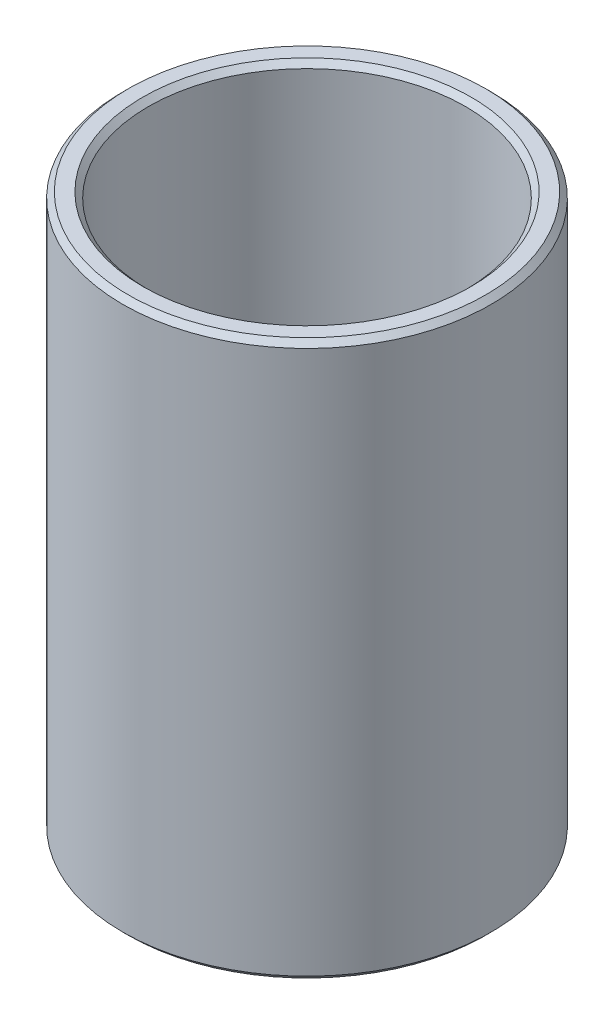
ISO-10303-21;
HEADER;
FILE_DESCRIPTION(('STEP AP214'),'2;1');
FILE_NAME('part.step','',(''),(''),'','','');
FILE_SCHEMA(('AUTOMOTIVE_DESIGN { 1 0 10303 214 1 1 1 1 }'));
ENDSEC;
DATA;
#1=APPLICATION_CONTEXT('core data for automotive mechanical design processes');
#2=APPLICATION_PROTOCOL_DEFINITION('international standard','automotive_design',2000,#1);
#3=PRODUCT_CONTEXT('',#1,'mechanical');
#4=PRODUCT('Part','Part','',(#3));
#5=PRODUCT_RELATED_PRODUCT_CATEGORY('part','',(#4));
#6=PRODUCT_DEFINITION_FORMATION('','',#4);
#7=PRODUCT_DEFINITION_CONTEXT('part definition',#1,'design');
#8=PRODUCT_DEFINITION('design','',#6,#7);
#9=PRODUCT_DEFINITION_SHAPE('','',#8);
#10=(LENGTH_UNIT() NAMED_UNIT(*) SI_UNIT(.MILLI.,.METRE.));
#11=(NAMED_UNIT(*) PLANE_ANGLE_UNIT() SI_UNIT($,.RADIAN.));
#12=(NAMED_UNIT(*) SI_UNIT($,.STERADIAN.) SOLID_ANGLE_UNIT());
#13=UNCERTAINTY_MEASURE_WITH_UNIT(LENGTH_MEASURE(1.E-05),#10,'distance_accuracy_value','');
#14=(GEOMETRIC_REPRESENTATION_CONTEXT(3) GLOBAL_UNCERTAINTY_ASSIGNED_CONTEXT((#13)) GLOBAL_UNIT_ASSIGNED_CONTEXT((#10,
#11,#12)) REPRESENTATION_CONTEXT('',''));
#15=CARTESIAN_POINT('',(0.,0.,0.));
#16=DIRECTION('',(0.,0.,1.));
#17=DIRECTION('',(1.,0.,0.));
#18=AXIS2_PLACEMENT_3D('',#15,#16,#17);
#19=CARTESIAN_POINT('',(0.,150.586596938026,0.));
#20=DIRECTION('',(0.,-1.,0.));
#21=DIRECTION('',(0.,0.,-1.));
#22=AXIS2_PLACEMENT_3D('',#19,#20,#21);
#23=CYLINDRICAL_SURFACE('',#22,50.);
#24=CARTESIAN_POINT('',(0.,1.48675893451039,0.));
#25=DIRECTION('',(0.,1.,0.));
#26=DIRECTION('',(0.,0.,1.));
#27=AXIS2_PLACEMENT_3D('',#24,#25,#26);
#28=CIRCLE('',#27,50.);
#29=CARTESIAN_POINT('',(0.,1.48675893451039,-50.));
#30=VERTEX_POINT('',#29);
#31=EDGE_CURVE('E10',#30,#30,#28,.T.);
#32=CARTESIAN_POINT('',(0.,149.099838003515,0.));
#33=DIRECTION('',(0.,1.,0.));
#34=DIRECTION('',(0.,0.,1.));
#35=AXIS2_PLACEMENT_3D('',#32,#33,#34);
#36=CIRCLE('',#35,50.);
#37=CARTESIAN_POINT('',(0.,149.099838003515,-50.));
#38=VERTEX_POINT('',#37);
#39=EDGE_CURVE('E50',#38,#38,#36,.F.);
#40=CARTESIAN_POINT('',(0.,1.48675893451039,-50.));
#41=CARTESIAN_POINT('',(0.,3.02439517481253,-50.));
#42=CARTESIAN_POINT('',(0.,4.56203141511467,-50.));
#43=CARTESIAN_POINT('',(0.,7.63730389571894,-50.));
#44=CARTESIAN_POINT('',(0.,9.17494013602107,-50.));
#45=CARTESIAN_POINT('',(0.,12.2502126166253,-50.));
#46=CARTESIAN_POINT('',(0.,13.7878488569275,-50.));
#47=CARTESIAN_POINT('',(0.,16.8631213375317,-50.));
#48=CARTESIAN_POINT('',(0.,18.4007575778339,-50.));
#49=CARTESIAN_POINT('',(0.,21.4760300584381,-50.));
#50=CARTESIAN_POINT('',(0.,23.0136662987403,-50.));
#51=CARTESIAN_POINT('',(0.,26.0889387793446,-50.));
#52=CARTESIAN_POINT('',(0.,27.6265750196467,-50.));
#53=CARTESIAN_POINT('',(0.,30.701847500251,-50.));
#54=CARTESIAN_POINT('',(0.,32.2394837405531,-50.));
#55=CARTESIAN_POINT('',(0.,35.3147562211574,-50.));
#56=CARTESIAN_POINT('',(0.,36.8523924614595,-50.));
#57=CARTESIAN_POINT('',(0.,39.9276649420638,-50.));
#58=CARTESIAN_POINT('',(0.,41.4653011823659,-50.));
#59=CARTESIAN_POINT('',(0.,44.5405736629702,-50.));
#60=CARTESIAN_POINT('',(0.,46.0782099032723,-50.));
#61=CARTESIAN_POINT('',(0.,49.1534823838766,-50.));
#62=CARTESIAN_POINT('',(0.,50.6911186241787,-50.));
#63=CARTESIAN_POINT('',(0.,53.766391104783,-50.));
#64=CARTESIAN_POINT('',(0.,55.3040273450851,-50.));
#65=CARTESIAN_POINT('',(0.,58.3792998256894,-50.));
#66=CARTESIAN_POINT('',(0.,59.9169360659915,-50.));
#67=CARTESIAN_POINT('',(0.,62.9922085465958,-50.));
#68=CARTESIAN_POINT('',(0.,64.529844786898,-50.));
#69=CARTESIAN_POINT('',(0.,67.6051172675022,-50.));
#70=CARTESIAN_POINT('',(0.,69.1427535078044,-50.));
#71=CARTESIAN_POINT('',(0.,72.2180259884086,-50.));
#72=CARTESIAN_POINT('',(0.,73.7556622287108,-50.));
#73=CARTESIAN_POINT('',(0.,76.830934709315,-50.));
#74=CARTESIAN_POINT('',(0.,78.3685709496172,-50.));
#75=CARTESIAN_POINT('',(0.,81.4438434302214,-50.));
#76=CARTESIAN_POINT('',(0.,82.9814796705236,-50.));
#77=CARTESIAN_POINT('',(0.,86.0567521511278,-50.));
#78=CARTESIAN_POINT('',(0.,87.59438839143,-50.));
#79=CARTESIAN_POINT('',(0.,90.6696608720342,-50.));
#80=CARTESIAN_POINT('',(0.,92.2072971123364,-50.));
#81=CARTESIAN_POINT('',(0.,95.2825695929406,-50.));
#82=CARTESIAN_POINT('',(0.,96.8202058332428,-50.));
#83=CARTESIAN_POINT('',(0.,99.8954783138471,-50.));
#84=CARTESIAN_POINT('',(0.,101.433114554149,-50.));
#85=CARTESIAN_POINT('',(0.,104.508387034753,-50.));
#86=CARTESIAN_POINT('',(0.,106.046023275056,-50.));
#87=CARTESIAN_POINT('',(0.,109.12129575566,-50.));
#88=CARTESIAN_POINT('',(0.,110.658931995962,-50.));
#89=CARTESIAN_POINT('',(0.,113.734204476566,-50.));
#90=CARTESIAN_POINT('',(0.,115.271840716868,-50.));
#91=CARTESIAN_POINT('',(0.,118.347113197473,-50.));
#92=CARTESIAN_POINT('',(0.,119.884749437775,-50.));
#93=CARTESIAN_POINT('',(0.,122.960021918379,-50.));
#94=CARTESIAN_POINT('',(0.,124.497658158681,-50.));
#95=CARTESIAN_POINT('',(0.,127.572930639286,-50.));
#96=CARTESIAN_POINT('',(0.,129.110566879588,-50.));
#97=CARTESIAN_POINT('',(0.,132.185839360192,-50.));
#98=CARTESIAN_POINT('',(0.,133.723475600494,-50.));
#99=CARTESIAN_POINT('',(0.,136.798748081098,-50.));
#100=CARTESIAN_POINT('',(0.,138.3363843214,-50.));
#101=CARTESIAN_POINT('',(0.,141.411656802005,-50.));
#102=CARTESIAN_POINT('',(0.,142.949293042307,-50.));
#103=CARTESIAN_POINT('',(0.,146.024565522911,-50.));
#104=CARTESIAN_POINT('',(0.,147.562201763213,-50.));
#105=CARTESIAN_POINT('',(0.,149.099838003515,-50.));
#106=B_SPLINE_CURVE_WITH_KNOTS('',3,(#40,#41,#42,#43,#44,#45,#46,#47,#48,#49,#50,#51,#52,#53,
#54,#55,#56,#57,#58,#59,#60,#61,#62,#63,#64,#65,#66,#67,#68,#69,#70,#71,#72,#73,#74,#75,#76,#77,
#78,#79,#80,#81,#82,#83,#84,#85,#86,#87,#88,#89,#90,#91,#92,#93,#94,#95,#96,#97,#98,#99,#100,
#101,#102,#103,#104,#105),.UNSPECIFIED.,.F.,.F.,(4,2,2,2,2,2,2,2,2,2,2,2,2,2,2,2,2,2,2,2,2,2,2,
2,2,2,2,2,2,2,2,2,4),(0.,4.61290872090642,9.22581744181281,13.8387261627192,18.4516348836256,
23.064543604532,27.6774523254384,32.2903610463448,36.9032697672513,41.5161784881577,
46.1290872090641,50.7419959299705,55.3549046508769,59.9678133717833,64.5807220926897,
69.1936308135961,73.8065395345025,78.4194482554089,83.0323569763153,87.6452656972217,
92.2581744181281,96.8710831390345,101.483991859941,106.096900580847,110.709809301754,
115.32271802266,119.935626743567,124.548535464473,129.161444185379,133.774352906286,
138.387261627192,143.000170348099,147.613079069005),.UNSPECIFIED.);
#107=EDGE_CURVE('BSEAM39',#30,#38,#106,.T.);
#108=ORIENTED_EDGE('',*,*,#31,.T.);
#109=ORIENTED_EDGE('',*,*,#39,.T.);
#110=ORIENTED_EDGE('',*,*,#107,.T.);
#111=ORIENTED_EDGE('',*,*,#107,.F.);
#112=EDGE_LOOP('',(#108,#110,#109,#111));
#113=FACE_BOUND('',#112,.T.);
#114=ADVANCED_FACE('F39',(#113),#23,.T.);
#115=CARTESIAN_POINT('',(0.,150.586596938026,0.));
#116=DIRECTION('',(0.,1.,0.));
#117=DIRECTION('',(0.,0.,1.));
#118=AXIS2_PLACEMENT_3D('',#115,#116,#117);
#119=PLANE('',#118);
#120=CARTESIAN_POINT('',(0.,150.586596938026,0.));
#121=DIRECTION('',(0.,1.,0.));
#122=DIRECTION('',(0.,0.,1.));
#123=AXIS2_PLACEMENT_3D('',#120,#121,#122);
#124=CIRCLE('',#123,44.5659587870509);
#125=CARTESIAN_POINT('',(0.,150.586596938026,44.5659587870509));
#126=VERTEX_POINT('',#125);
#127=EDGE_CURVE('E58',#126,#126,#124,.F.);
#128=ORIENTED_EDGE('',*,*,#127,.T.);
#129=EDGE_LOOP('',(#128));
#130=FACE_BOUND('',#129,.T.);
#131=CARTESIAN_POINT('',(0.,150.586596938026,0.));
#132=DIRECTION('',(0.,1.,0.));
#133=DIRECTION('',(0.,0.,1.));
#134=AXIS2_PLACEMENT_3D('',#131,#132,#133);
#135=CIRCLE('',#134,48.5132410654896);
#136=CARTESIAN_POINT('',(0.,150.586596938026,-48.5132410654896));
#137=VERTEX_POINT('',#136);
#138=EDGE_CURVE('E61',#137,#137,#135,.T.);
#139=ORIENTED_EDGE('',*,*,#138,.T.);
#140=EDGE_LOOP('',(#139));
#141=FACE_BOUND('',#140,.T.);
#142=ADVANCED_FACE('F88',(#130,#141),#119,.T.);
#143=CARTESIAN_POINT('',(0.,0.,0.));
#144=DIRECTION('',(0.,1.,0.));
#145=DIRECTION('',(0.,0.,1.));
#146=AXIS2_PLACEMENT_3D('',#143,#144,#145);
#147=PLANE('',#146);
#148=CARTESIAN_POINT('',(0.,0.,0.));
#149=DIRECTION('',(0.,1.,0.));
#150=DIRECTION('',(0.,0.,1.));
#151=AXIS2_PLACEMENT_3D('',#148,#149,#150);
#152=CIRCLE('',#151,44.5659587870509);
#153=CARTESIAN_POINT('',(0.,0.,44.5659587870509));
#154=VERTEX_POINT('',#153);
#155=EDGE_CURVE('E51',#154,#154,#152,.T.);
#156=ORIENTED_EDGE('',*,*,#155,.T.);
#157=EDGE_LOOP('',(#156));
#158=FACE_BOUND('',#157,.T.);
#159=CARTESIAN_POINT('',(0.,0.,0.));
#160=DIRECTION('',(0.,1.,0.));
#161=DIRECTION('',(0.,0.,1.));
#162=AXIS2_PLACEMENT_3D('',#159,#160,#161);
#163=CIRCLE('',#162,48.5132410654896);
#164=CARTESIAN_POINT('',(0.,0.,48.5132410654896));
#165=VERTEX_POINT('',#164);
#166=EDGE_CURVE('E54',#165,#165,#163,.F.);
#167=ORIENTED_EDGE('',*,*,#166,.T.);
#168=EDGE_LOOP('',(#167));
#169=FACE_BOUND('',#168,.T.);
#170=ADVANCED_FACE('F83',(#158,#169),#147,.F.);
#171=CARTESIAN_POINT('',(0.,150.586596938026,0.));
#172=DIRECTION('',(0.,-1.,0.));
#173=DIRECTION('',(0.,0.,-1.));
#174=AXIS2_PLACEMENT_3D('',#171,#172,#173);
#175=CYLINDRICAL_SURFACE('',#174,43.0791998525405);
#176=CARTESIAN_POINT('',(0.,149.099838003515,0.));
#177=DIRECTION('',(0.,1.,0.));
#178=DIRECTION('',(0.,0.,1.));
#179=AXIS2_PLACEMENT_3D('',#176,#177,#178);
#180=CIRCLE('',#179,43.0791998525405);
#181=CARTESIAN_POINT('',(0.,149.099838003515,43.0791998525405));
#182=VERTEX_POINT('',#181);
#183=EDGE_CURVE('E67',#182,#182,#180,.T.);
#184=ORIENTED_EDGE('',*,*,#183,.T.);
#185=EDGE_LOOP('',(#184));
#186=FACE_BOUND('',#185,.T.);
#187=CARTESIAN_POINT('',(0.,1.48675893451045,0.));
#188=DIRECTION('',(0.,1.,0.));
#189=DIRECTION('',(0.,0.,1.));
#190=AXIS2_PLACEMENT_3D('',#187,#188,#189);
#191=CIRCLE('',#190,43.0791998525405);
#192=CARTESIAN_POINT('',(0.,1.48675893451045,43.0791998525405));
#193=VERTEX_POINT('',#192);
#194=EDGE_CURVE('E69',#193,#193,#191,.F.);
#195=ORIENTED_EDGE('',*,*,#194,.T.);
#196=EDGE_LOOP('',(#195));
#197=FACE_BOUND('',#196,.T.);
#198=ADVANCED_FACE('F71',(#186,#197),#175,.F.);
#199=CARTESIAN_POINT('',(0.,149.099838003515,0.));
#200=DIRECTION('',(0.,1.,0.));
#201=DIRECTION('',(0.,0.,1.));
#202=AXIS2_PLACEMENT_3D('',#199,#200,#201);
#203=CONICAL_SURFACE('',#202,43.0791998525405,0.785398163397453);
#204=CARTESIAN_POINT('',(0.,150.586596938026,44.5659587870509));
#205=CARTESIAN_POINT('',(0.,150.571109865791,44.5504717148164));
#206=CARTESIAN_POINT('',(0.,150.555622793557,44.5349846425819));
#207=CARTESIAN_POINT('',(0.,150.524648649088,44.5040104981129));
#208=CARTESIAN_POINT('',(0.,150.509161576853,44.4885234258785));
#209=CARTESIAN_POINT('',(0.,150.478187432384,44.4575492814095));
#210=CARTESIAN_POINT('',(0.,150.46270036015,44.442062209175));
#211=CARTESIAN_POINT('',(0.,150.431726215681,44.411088064706));
#212=CARTESIAN_POINT('',(0.,150.416239143446,44.3956009924716));
#213=CARTESIAN_POINT('',(0.,150.385264998978,44.3646268480026));
#214=CARTESIAN_POINT('',(0.,150.369777926743,44.3491397757681));
#215=CARTESIAN_POINT('',(0.,150.338803782274,44.3181656312991));
#216=CARTESIAN_POINT('',(0.,150.32331671004,44.3026785590647));
#217=CARTESIAN_POINT('',(0.,150.292342565571,44.2717044145957));
#218=CARTESIAN_POINT('',(0.,150.276855493336,44.2562173423612));
#219=CARTESIAN_POINT('',(0.,150.245881348867,44.2252431978922));
#220=CARTESIAN_POINT('',(0.,150.230394276633,44.2097561256578));
#221=CARTESIAN_POINT('',(0.,150.199420132164,44.1787819811888));
#222=CARTESIAN_POINT('',(0.,150.183933059929,44.1632949089543));
#223=CARTESIAN_POINT('',(0.,150.15295891546,44.1323207644853));
#224=CARTESIAN_POINT('',(0.,150.137471843226,44.1168336922509));
#225=CARTESIAN_POINT('',(0.,150.106497698757,44.0858595477819));
#226=CARTESIAN_POINT('',(0.,150.091010626522,44.0703724755474));
#227=CARTESIAN_POINT('',(0.,150.060036482053,44.0393983310784));
#228=CARTESIAN_POINT('',(0.,150.044549409819,44.023911258844));
#229=CARTESIAN_POINT('',(0.,150.01357526535,43.992937114375));
#230=CARTESIAN_POINT('',(0.,149.998088193115,43.9774500421405));
#231=CARTESIAN_POINT('',(0.,149.967114048646,43.9464758976715));
#232=CARTESIAN_POINT('',(0.,149.951626976412,43.9309888254371));
#233=CARTESIAN_POINT('',(0.,149.920652831943,43.9000146809681));
#234=CARTESIAN_POINT('',(0.,149.905165759708,43.8845276087336));
#235=CARTESIAN_POINT('',(0.,149.87419161524,43.8535534642646));
#236=CARTESIAN_POINT('',(0.,149.858704543005,43.8380663920302));
#237=CARTESIAN_POINT('',(0.,149.827730398536,43.8070922475612));
#238=CARTESIAN_POINT('',(0.,149.812243326302,43.7916051753267));
#239=CARTESIAN_POINT('',(0.,149.781269181833,43.7606310308577));
#240=CARTESIAN_POINT('',(0.,149.765782109598,43.7451439586233));
#241=CARTESIAN_POINT('',(0.,149.734807965129,43.7141698141543));
#242=CARTESIAN_POINT('',(0.,149.719320892895,43.6986827419198));
#243=CARTESIAN_POINT('',(0.,149.688346748426,43.6677085974508));
#244=CARTESIAN_POINT('',(0.,149.672859676191,43.6522215252164));
#245=CARTESIAN_POINT('',(0.,149.641885531722,43.6212473807474));
#246=CARTESIAN_POINT('',(0.,149.626398459488,43.6057603085129));
#247=CARTESIAN_POINT('',(0.,149.595424315019,43.5747861640439));
#248=CARTESIAN_POINT('',(0.,149.579937242784,43.5592990918095));
#249=CARTESIAN_POINT('',(0.,149.548963098315,43.5283249473405));
#250=CARTESIAN_POINT('',(0.,149.533476026081,43.512837875106));
#251=CARTESIAN_POINT('',(0.,149.502501881612,43.481863730637));
#252=CARTESIAN_POINT('',(0.,149.487014809377,43.4663766584025));
#253=CARTESIAN_POINT('',(0.,149.456040664908,43.4354025139336));
#254=CARTESIAN_POINT('',(0.,149.440553592674,43.4199154416991));
#255=CARTESIAN_POINT('',(0.,149.409579448205,43.3889412972301));
#256=CARTESIAN_POINT('',(0.,149.394092375971,43.3734542249957));
#257=CARTESIAN_POINT('',(0.,149.363118231502,43.3424800805267));
#258=CARTESIAN_POINT('',(0.,149.347631159267,43.3269930082922));
#259=CARTESIAN_POINT('',(0.,149.316657014798,43.2960188638232));
#260=CARTESIAN_POINT('',(0.,149.301169942564,43.2805317915887));
#261=CARTESIAN_POINT('',(0.,149.270195798095,43.2495576471198));
#262=CARTESIAN_POINT('',(0.,149.25470872586,43.2340705748853));
#263=CARTESIAN_POINT('',(0.,149.223734581391,43.2030964304163));
#264=CARTESIAN_POINT('',(0.,149.208247509157,43.1876093581819));
#265=CARTESIAN_POINT('',(0.,149.177273364688,43.1566352137129));
#266=CARTESIAN_POINT('',(0.,149.161786292453,43.1411481414784));
#267=CARTESIAN_POINT('',(0.,149.130812147984,43.1101739970094));
#268=CARTESIAN_POINT('',(0.,149.11532507575,43.094686924775));
#269=CARTESIAN_POINT('',(0.,149.099838003515,43.0791998525405));
#270=B_SPLINE_CURVE_WITH_KNOTS('',3,(#204,#205,#206,#207,#208,#209,#210,#211,#212,#213,#214,
#215,#216,#217,#218,#219,#220,#221,#222,#223,#224,#225,#226,#227,#228,#229,#230,#231,#232,#233,
#234,#235,#236,#237,#238,#239,#240,#241,#242,#243,#244,#245,#246,#247,#248,#249,#250,#251,#252,
#253,#254,#255,#256,#257,#258,#259,#260,#261,#262,#263,#264,#265,#266,#267,#268,#269),
.UNSPECIFIED.,.F.,.F.,(4,2,2,2,2,2,2,2,2,2,2,2,2,2,2,2,2,2,2,2,2,2,2,2,2,2,2,2,2,2,2,2,4),(0.,
0.0657060827863617,0.131412165572743,0.197118248359119,0.262824331145481,0.328530413931862,
0.394236496718244,0.459942579504605,0.525648662290982,0.591354745077363,0.657060827863725,
0.722766910650106,0.788472993436487,0.854179076222849,0.919885159009225,0.985591241795607,
1.05129732458199,1.11700340736835,1.18270949015473,1.24841557294111,1.31412165572747,
1.37982773851385,1.44553382130023,1.51123990408659,1.57694598687297,1.64265206965935,
1.70835815244571,1.77406423523209,1.83977031801848,1.90547640080484,1.97118248359121,
2.0368885663776,2.10259464916396),.UNSPECIFIED.);
#271=EDGE_CURVE('BSEAM77',#126,#182,#270,.T.);
#272=ORIENTED_EDGE('',*,*,#127,.F.);
#273=ORIENTED_EDGE('',*,*,#183,.F.);
#274=ORIENTED_EDGE('',*,*,#271,.T.);
#275=ORIENTED_EDGE('',*,*,#271,.F.);
#276=EDGE_LOOP('',(#272,#274,#273,#275));
#277=FACE_BOUND('',#276,.T.);
#278=ADVANCED_FACE('F77',(#277),#203,.F.);
#279=CARTESIAN_POINT('',(0.,0.,0.));
#280=DIRECTION('',(0.,-1.,0.));
#281=DIRECTION('',(0.,0.,-1.));
#282=AXIS2_PLACEMENT_3D('',#279,#280,#281);
#283=CONICAL_SURFACE('',#282,44.5659587870509,0.785398163397444);
#284=ORIENTED_EDGE('',*,*,#194,.F.);
#285=EDGE_LOOP('',(#284));
#286=FACE_BOUND('',#285,.T.);
#287=ORIENTED_EDGE('',*,*,#155,.F.);
#288=EDGE_LOOP('',(#287));
#289=FACE_BOUND('',#288,.T.);
#290=ADVANCED_FACE('F73',(#286,#289),#283,.F.);
#291=CARTESIAN_POINT('',(0.,1.48675893451039,0.));
#292=DIRECTION('',(0.,1.,0.));
#293=DIRECTION('',(0.,0.,1.));
#294=AXIS2_PLACEMENT_3D('',#291,#292,#293);
#295=CONICAL_SURFACE('',#294,50.,0.78539816339746);
#296=ORIENTED_EDGE('',*,*,#166,.F.);
#297=EDGE_LOOP('',(#296));
#298=FACE_BOUND('',#297,.T.);
#299=ORIENTED_EDGE('',*,*,#31,.F.);
#300=EDGE_LOOP('',(#299));
#301=FACE_BOUND('',#300,.T.);
#302=ADVANCED_FACE('F76',(#298,#301),#295,.T.);
#303=CARTESIAN_POINT('',(0.,150.586596938026,0.));
#304=DIRECTION('',(0.,-1.,0.));
#305=DIRECTION('',(0.,0.,-1.));
#306=AXIS2_PLACEMENT_3D('',#303,#304,#305);
#307=CONICAL_SURFACE('',#306,48.5132410654896,0.785398163397444);
#308=CARTESIAN_POINT('',(0.,149.099838003515,-50.));
#309=CARTESIAN_POINT('',(0.,149.11532507575,-49.9845129277655));
#310=CARTESIAN_POINT('',(0.,149.130812147984,-49.9690258555311));
#311=CARTESIAN_POINT('',(0.,149.161786292453,-49.9380517110621));
#312=CARTESIAN_POINT('',(0.,149.177273364688,-49.9225646388276));
#313=CARTESIAN_POINT('',(0.,149.208247509157,-49.8915904943586));
#314=CARTESIAN_POINT('',(0.,149.223734581391,-49.8761034221242));
#315=CARTESIAN_POINT('',(0.,149.25470872586,-49.8451292776552));
#316=CARTESIAN_POINT('',(0.,149.270195798095,-49.8296422054207));
#317=CARTESIAN_POINT('',(0.,149.301169942564,-49.7986680609517));
#318=CARTESIAN_POINT('',(0.,149.316657014798,-49.7831809887172));
#319=CARTESIAN_POINT('',(0.,149.347631159267,-49.7522068442483));
#320=CARTESIAN_POINT('',(0.,149.363118231502,-49.7367197720138));
#321=CARTESIAN_POINT('',(0.,149.394092375971,-49.7057456275448));
#322=CARTESIAN_POINT('',(0.,149.409579448205,-49.6902585553104));
#323=CARTESIAN_POINT('',(0.,149.440553592674,-49.6592844108414));
#324=CARTESIAN_POINT('',(0.,149.456040664908,-49.6437973386069));
#325=CARTESIAN_POINT('',(0.,149.487014809377,-49.6128231941379));
#326=CARTESIAN_POINT('',(0.,149.502501881612,-49.5973361219035));
#327=CARTESIAN_POINT('',(0.,149.533476026081,-49.5663619774345));
#328=CARTESIAN_POINT('',(0.,149.548963098315,-49.5508749052));
#329=CARTESIAN_POINT('',(0.,149.579937242784,-49.519900760731));
#330=CARTESIAN_POINT('',(0.,149.595424315019,-49.5044136884966));
#331=CARTESIAN_POINT('',(0.,149.626398459488,-49.4734395440276));
#332=CARTESIAN_POINT('',(0.,149.641885531722,-49.4579524717931));
#333=CARTESIAN_POINT('',(0.,149.672859676191,-49.4269783273241));
#334=CARTESIAN_POINT('',(0.,149.688346748426,-49.4114912550897));
#335=CARTESIAN_POINT('',(0.,149.719320892895,-49.3805171106207));
#336=CARTESIAN_POINT('',(0.,149.734807965129,-49.3650300383862));
#337=CARTESIAN_POINT('',(0.,149.765782109598,-49.3340558939172));
#338=CARTESIAN_POINT('',(0.,149.781269181833,-49.3185688216828));
#339=CARTESIAN_POINT('',(0.,149.812243326302,-49.2875946772138));
#340=CARTESIAN_POINT('',(0.,149.827730398536,-49.2721076049793));
#341=CARTESIAN_POINT('',(0.,149.858704543005,-49.2411334605103));
#342=CARTESIAN_POINT('',(0.,149.87419161524,-49.2256463882759));
#343=CARTESIAN_POINT('',(0.,149.905165759708,-49.1946722438069));
#344=CARTESIAN_POINT('',(0.,149.920652831943,-49.1791851715724));
#345=CARTESIAN_POINT('',(0.,149.951626976412,-49.1482110271035));
#346=CARTESIAN_POINT('',(0.,149.967114048646,-49.132723954869));
#347=CARTESIAN_POINT('',(0.,149.998088193115,-49.1017498104));
#348=CARTESIAN_POINT('',(0.,150.01357526535,-49.0862627381655));
#349=CARTESIAN_POINT('',(0.,150.044549409819,-49.0552885936965));
#350=CARTESIAN_POINT('',(0.,150.060036482053,-49.0398015214621));
#351=CARTESIAN_POINT('',(0.,150.091010626522,-49.0088273769931));
#352=CARTESIAN_POINT('',(0.,150.106497698757,-48.9933403047586));
#353=CARTESIAN_POINT('',(0.,150.137471843226,-48.9623661602896));
#354=CARTESIAN_POINT('',(0.,150.15295891546,-48.9468790880552));
#355=CARTESIAN_POINT('',(0.,150.183933059929,-48.9159049435862));
#356=CARTESIAN_POINT('',(0.,150.199420132164,-48.9004178713517));
#357=CARTESIAN_POINT('',(0.,150.230394276633,-48.8694437268828));
#358=CARTESIAN_POINT('',(0.,150.245881348867,-48.8539566546483));
#359=CARTESIAN_POINT('',(0.,150.276855493336,-48.8229825101793));
#360=CARTESIAN_POINT('',(0.,150.292342565571,-48.8074954379448));
#361=CARTESIAN_POINT('',(0.,150.32331671004,-48.7765212934759));
#362=CARTESIAN_POINT('',(0.,150.338803782274,-48.7610342212414));
#363=CARTESIAN_POINT('',(0.,150.369777926743,-48.7300600767724));
#364=CARTESIAN_POINT('',(0.,150.385264998978,-48.7145730045379));
#365=CARTESIAN_POINT('',(0.,150.416239143446,-48.683598860069));
#366=CARTESIAN_POINT('',(0.,150.431726215681,-48.6681117878345));
#367=CARTESIAN_POINT('',(0.,150.46270036015,-48.6371376433655));
#368=CARTESIAN_POINT('',(0.,150.478187432384,-48.621650571131));
#369=CARTESIAN_POINT('',(0.,150.509161576853,-48.590676426662));
#370=CARTESIAN_POINT('',(0.,150.524648649088,-48.5751893544276));
#371=CARTESIAN_POINT('',(0.,150.555622793557,-48.5442152099586));
#372=CARTESIAN_POINT('',(0.,150.571109865791,-48.5287281377241));
#373=CARTESIAN_POINT('',(0.,150.586596938026,-48.5132410654896));
#374=B_SPLINE_CURVE_WITH_KNOTS('',3,(#308,#309,#310,#311,#312,#313,#314,#315,#316,#317,#318,
#319,#320,#321,#322,#323,#324,#325,#326,#327,#328,#329,#330,#331,#332,#333,#334,#335,#336,#337,
#338,#339,#340,#341,#342,#343,#344,#345,#346,#347,#348,#349,#350,#351,#352,#353,#354,#355,#356,
#357,#358,#359,#360,#361,#362,#363,#364,#365,#366,#367,#368,#369,#370,#371,#372,#373),
.UNSPECIFIED.,.F.,.F.,(4,2,2,2,2,2,2,2,2,2,2,2,2,2,2,2,2,2,2,2,2,2,2,2,2,2,2,2,2,2,2,2,4),(0.,
0.0657060827863813,0.131412165572758,0.197118248359139,0.262824331145501,0.328530413931877,
0.394236496718258,0.45994257950462,0.525648662290996,0.591354745077378,0.657060827863739,
0.722766910650121,0.788472993436497,0.854179076222859,0.91988515900924,0.985591241795616,
1.05129732458198,1.11700340736836,1.18270949015474,1.24841557294112,1.31412165572748,
1.37982773851386,1.44553382130024,1.5112399040866,1.57694598687297,1.64265206965936,
1.70835815244572,1.7740642352321,1.83977031801848,1.90547640080484,1.97118248359122,
2.03688856637759,2.10259464916398),.UNSPECIFIED.);
#375=EDGE_CURVE('BSEAM45',#38,#137,#374,.T.);
#376=ORIENTED_EDGE('',*,*,#39,.F.);
#377=ORIENTED_EDGE('',*,*,#138,.F.);
#378=ORIENTED_EDGE('',*,*,#375,.T.);
#379=ORIENTED_EDGE('',*,*,#375,.F.);
#380=EDGE_LOOP('',(#376,#378,#377,#379));
#381=FACE_BOUND('',#380,.T.);
#382=ADVANCED_FACE('F45',(#381),#307,.T.);
#383=CLOSED_SHELL('',(#114,#142,#170,#198,#278,#290,#302,#382));
#384=MANIFOLD_SOLID_BREP('B2',#383);
#385=ADVANCED_BREP_SHAPE_REPRESENTATION('',(#18,#384),#14);
#386=SHAPE_DEFINITION_REPRESENTATION(#9,#385);
ENDSEC;
END-ISO-10303-21;
